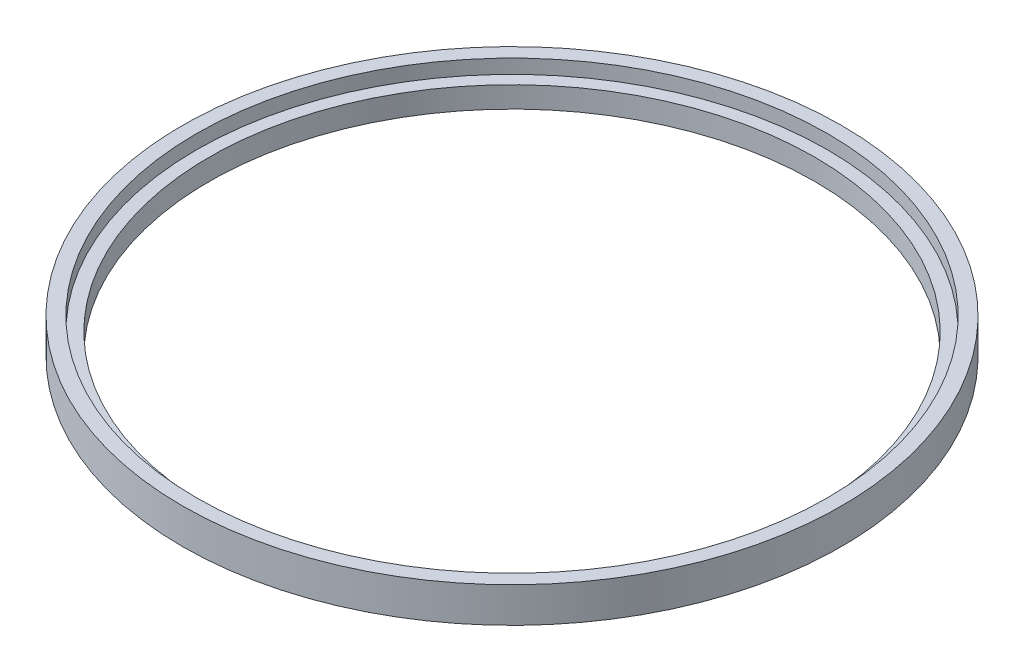
ISO-10303-21;
HEADER;
FILE_DESCRIPTION(('STEP AP214'),'2;1');
FILE_NAME('part.step','',(''),(''),'','','');
FILE_SCHEMA(('AUTOMOTIVE_DESIGN { 1 0 10303 214 1 1 1 1 }'));
ENDSEC;
DATA;
#1=APPLICATION_CONTEXT('core data for automotive mechanical design processes');
#2=APPLICATION_PROTOCOL_DEFINITION('international standard','automotive_design',2000,#1);
#3=PRODUCT_CONTEXT('',#1,'mechanical');
#4=PRODUCT('Part','Part','',(#3));
#5=PRODUCT_RELATED_PRODUCT_CATEGORY('part','',(#4));
#6=PRODUCT_DEFINITION_FORMATION('','',#4);
#7=PRODUCT_DEFINITION_CONTEXT('part definition',#1,'design');
#8=PRODUCT_DEFINITION('design','',#6,#7);
#9=PRODUCT_DEFINITION_SHAPE('','',#8);
#10=(LENGTH_UNIT() NAMED_UNIT(*) SI_UNIT(.MILLI.,.METRE.));
#11=(NAMED_UNIT(*) PLANE_ANGLE_UNIT() SI_UNIT($,.RADIAN.));
#12=(NAMED_UNIT(*) SI_UNIT($,.STERADIAN.) SOLID_ANGLE_UNIT());
#13=UNCERTAINTY_MEASURE_WITH_UNIT(LENGTH_MEASURE(1.E-05),#10,'distance_accuracy_value','');
#14=(GEOMETRIC_REPRESENTATION_CONTEXT(3) GLOBAL_UNCERTAINTY_ASSIGNED_CONTEXT((#13)) GLOBAL_UNIT_ASSIGNED_CONTEXT((#10,
#11,#12)) REPRESENTATION_CONTEXT('',''));
#15=CARTESIAN_POINT('',(0.,0.,0.));
#16=DIRECTION('',(0.,0.,1.));
#17=DIRECTION('',(1.,0.,0.));
#18=AXIS2_PLACEMENT_3D('',#15,#16,#17);
#19=CARTESIAN_POINT('',(0.,1.5,0.));
#20=DIRECTION('',(0.,1.,0.));
#21=DIRECTION('',(0.,0.,1.));
#22=AXIS2_PLACEMENT_3D('',#19,#20,#21);
#23=PLANE('',#22);
#24=CARTESIAN_POINT('',(0.,1.5,0.));
#25=DIRECTION('',(0.,1.,0.));
#26=DIRECTION('',(0.,0.,1.));
#27=AXIS2_PLACEMENT_3D('',#24,#25,#26);
#28=CIRCLE('',#27,21.5);
#29=CARTESIAN_POINT('',(0.,1.5,21.5));
#30=VERTEX_POINT('',#29);
#31=EDGE_CURVE('E45',#30,#30,#28,.T.);
#32=ORIENTED_EDGE('',*,*,#31,.F.);
#33=EDGE_LOOP('',(#32));
#34=FACE_BOUND('',#33,.T.);
#35=CARTESIAN_POINT('',(0.,1.5,0.));
#36=DIRECTION('',(0.,1.,0.));
#37=DIRECTION('',(0.,0.,1.));
#38=AXIS2_PLACEMENT_3D('',#35,#36,#37);
#39=CIRCLE('',#38,22.4);
#40=CARTESIAN_POINT('',(0.,1.5,22.4));
#41=VERTEX_POINT('',#40);
#42=EDGE_CURVE('E62',#41,#41,#39,.T.);
#43=ORIENTED_EDGE('',*,*,#42,.T.);
#44=EDGE_LOOP('',(#43));
#45=FACE_BOUND('',#44,.T.);
#46=ADVANCED_FACE('F37',(#34,#45),#23,.T.);
#47=CARTESIAN_POINT('',(0.,0.,0.));
#48=DIRECTION('',(0.,1.,0.));
#49=DIRECTION('',(0.,0.,1.));
#50=AXIS2_PLACEMENT_3D('',#47,#48,#49);
#51=PLANE('',#50);
#52=CARTESIAN_POINT('',(0.,0.,0.));
#53=DIRECTION('',(0.,1.,0.));
#54=DIRECTION('',(0.,0.,1.));
#55=AXIS2_PLACEMENT_3D('',#52,#53,#54);
#56=CIRCLE('',#55,23.4);
#57=CARTESIAN_POINT('',(0.,0.,23.4));
#58=VERTEX_POINT('',#57);
#59=EDGE_CURVE('E10',#58,#58,#56,.T.);
#60=ORIENTED_EDGE('',*,*,#59,.F.);
#61=EDGE_LOOP('',(#60));
#62=FACE_BOUND('',#61,.T.);
#63=CARTESIAN_POINT('',(0.,0.,0.));
#64=DIRECTION('',(0.,1.,0.));
#65=DIRECTION('',(0.,0.,1.));
#66=AXIS2_PLACEMENT_3D('',#63,#64,#65);
#67=CIRCLE('',#66,21.5);
#68=CARTESIAN_POINT('',(0.,0.,21.5));
#69=VERTEX_POINT('',#68);
#70=EDGE_CURVE('E50',#69,#69,#67,.T.);
#71=ORIENTED_EDGE('',*,*,#70,.T.);
#72=EDGE_LOOP('',(#71));
#73=FACE_BOUND('',#72,.T.);
#74=ADVANCED_FACE('F85',(#62,#73),#51,.F.);
#75=CARTESIAN_POINT('',(0.,1.5,0.));
#76=DIRECTION('',(0.,-1.,0.));
#77=DIRECTION('',(0.,0.,-1.));
#78=AXIS2_PLACEMENT_3D('',#75,#76,#77);
#79=CYLINDRICAL_SURFACE('',#78,23.4);
#80=ORIENTED_EDGE('',*,*,#59,.T.);
#81=EDGE_LOOP('',(#80));
#82=FACE_BOUND('',#81,.T.);
#83=CARTESIAN_POINT('',(0.,2.5,0.));
#84=DIRECTION('',(0.,1.,0.));
#85=DIRECTION('',(0.,0.,1.));
#86=AXIS2_PLACEMENT_3D('',#83,#84,#85);
#87=CIRCLE('',#86,23.4);
#88=CARTESIAN_POINT('',(0.,2.5,23.4));
#89=VERTEX_POINT('',#88);
#90=EDGE_CURVE('E56',#89,#89,#87,.T.);
#91=ORIENTED_EDGE('',*,*,#90,.F.);
#92=EDGE_LOOP('',(#91));
#93=FACE_BOUND('',#92,.T.);
#94=ADVANCED_FACE('F39',(#82,#93),#79,.T.);
#95=CARTESIAN_POINT('',(0.,1.5,0.));
#96=DIRECTION('',(0.,-1.,0.));
#97=DIRECTION('',(0.,0.,-1.));
#98=AXIS2_PLACEMENT_3D('',#95,#96,#97);
#99=CYLINDRICAL_SURFACE('',#98,21.5);
#100=ORIENTED_EDGE('',*,*,#31,.T.);
#101=EDGE_LOOP('',(#100));
#102=FACE_BOUND('',#101,.T.);
#103=ORIENTED_EDGE('',*,*,#70,.F.);
#104=EDGE_LOOP('',(#103));
#105=FACE_BOUND('',#104,.T.);
#106=ADVANCED_FACE('F75',(#102,#105),#99,.F.);
#107=CARTESIAN_POINT('',(0.,2.5,0.));
#108=DIRECTION('',(0.,1.,0.));
#109=DIRECTION('',(0.,0.,1.));
#110=AXIS2_PLACEMENT_3D('',#107,#108,#109);
#111=PLANE('',#110);
#112=ORIENTED_EDGE('',*,*,#90,.T.);
#113=EDGE_LOOP('',(#112));
#114=FACE_BOUND('',#113,.T.);
#115=CARTESIAN_POINT('',(0.,2.5,0.));
#116=DIRECTION('',(0.,1.,0.));
#117=DIRECTION('',(0.,0.,1.));
#118=AXIS2_PLACEMENT_3D('',#115,#116,#117);
#119=CIRCLE('',#118,22.4);
#120=CARTESIAN_POINT('',(0.,2.5,22.4));
#121=VERTEX_POINT('',#120);
#122=EDGE_CURVE('E61',#121,#121,#119,.T.);
#123=ORIENTED_EDGE('',*,*,#122,.F.);
#124=EDGE_LOOP('',(#123));
#125=FACE_BOUND('',#124,.T.);
#126=ADVANCED_FACE('F73',(#114,#125),#111,.T.);
#127=CARTESIAN_POINT('',(0.,2.5,0.));
#128=DIRECTION('',(0.,-1.,0.));
#129=DIRECTION('',(0.,0.,-1.));
#130=AXIS2_PLACEMENT_3D('',#127,#128,#129);
#131=CYLINDRICAL_SURFACE('',#130,22.4);
#132=ORIENTED_EDGE('',*,*,#122,.T.);
#133=EDGE_LOOP('',(#132));
#134=FACE_BOUND('',#133,.T.);
#135=ORIENTED_EDGE('',*,*,#42,.F.);
#136=EDGE_LOOP('',(#135));
#137=FACE_BOUND('',#136,.T.);
#138=ADVANCED_FACE('F70',(#134,#137),#131,.F.);
#139=CLOSED_SHELL('',(#46,#74,#94,#106,#126,#138));
#140=MANIFOLD_SOLID_BREP('B2',#139);
#141=ADVANCED_BREP_SHAPE_REPRESENTATION('',(#18,#140),#14);
#142=SHAPE_DEFINITION_REPRESENTATION(#9,#141);
ENDSEC;
END-ISO-10303-21;
